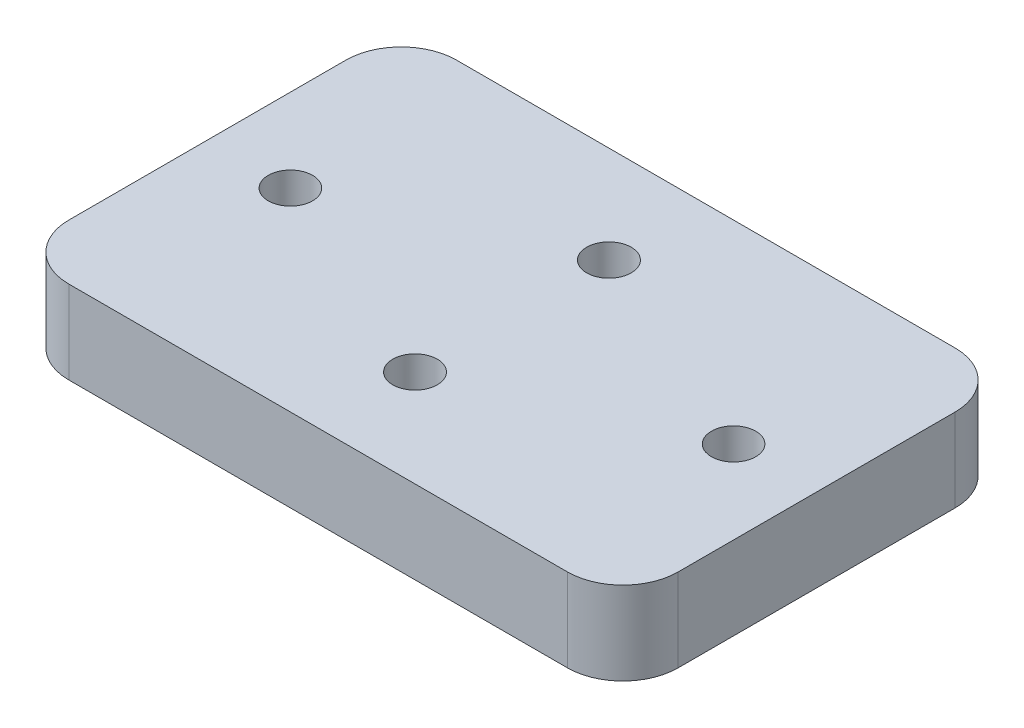
ISO-10303-21;
HEADER;
FILE_DESCRIPTION(('STEP AP214'),'2;1');
FILE_NAME('part.step','',(''),(''),'','','');
FILE_SCHEMA(('AUTOMOTIVE_DESIGN { 1 0 10303 214 1 1 1 1 }'));
ENDSEC;
DATA;
#1=APPLICATION_CONTEXT('core data for automotive mechanical design processes');
#2=APPLICATION_PROTOCOL_DEFINITION('international standard','automotive_design',2000,#1);
#3=PRODUCT_CONTEXT('',#1,'mechanical');
#4=PRODUCT('Part','Part','',(#3));
#5=PRODUCT_RELATED_PRODUCT_CATEGORY('part','',(#4));
#6=PRODUCT_DEFINITION_FORMATION('','',#4);
#7=PRODUCT_DEFINITION_CONTEXT('part definition',#1,'design');
#8=PRODUCT_DEFINITION('design','',#6,#7);
#9=PRODUCT_DEFINITION_SHAPE('','',#8);
#10=(LENGTH_UNIT() NAMED_UNIT(*) SI_UNIT(.MILLI.,.METRE.));
#11=(NAMED_UNIT(*) PLANE_ANGLE_UNIT() SI_UNIT($,.RADIAN.));
#12=(NAMED_UNIT(*) SI_UNIT($,.STERADIAN.) SOLID_ANGLE_UNIT());
#13=UNCERTAINTY_MEASURE_WITH_UNIT(LENGTH_MEASURE(1.E-05),#10,'distance_accuracy_value','');
#14=(GEOMETRIC_REPRESENTATION_CONTEXT(3) GLOBAL_UNCERTAINTY_ASSIGNED_CONTEXT((#13)) GLOBAL_UNIT_ASSIGNED_CONTEXT((#10,
#11,#12)) REPRESENTATION_CONTEXT('',''));
#15=CARTESIAN_POINT('',(0.,0.,0.));
#16=DIRECTION('',(0.,0.,1.));
#17=DIRECTION('',(1.,0.,0.));
#18=AXIS2_PLACEMENT_3D('',#15,#16,#17);
#19=CARTESIAN_POINT('',(34.925,9.525,-22.225));
#20=DIRECTION('',(-1.,0.,0.));
#21=DIRECTION('',(0.,0.,1.));
#22=AXIS2_PLACEMENT_3D('',#19,#20,#21);
#23=PLANE('',#22);
#24=DIRECTION('',(0.,0.,-1.));
#25=VECTOR('',#24,1.);
#26=CARTESIAN_POINT('',(34.925,9.525,-22.225));
#27=LINE('',#26,#25);
#28=CARTESIAN_POINT('',(34.925,9.525,15.875));
#29=VERTEX_POINT('',#28);
#30=CARTESIAN_POINT('',(34.925,9.525,-15.875));
#31=VERTEX_POINT('',#30);
#32=EDGE_CURVE('E135',#29,#31,#27,.T.);
#33=ORIENTED_EDGE('',*,*,#32,.F.);
#34=DIRECTION('',(0.,-1.,0.));
#35=VECTOR('',#34,1.);
#36=CARTESIAN_POINT('',(34.925,9.525,15.875));
#37=LINE('',#36,#35);
#38=CARTESIAN_POINT('',(34.925,0.,15.875));
#39=VERTEX_POINT('',#38);
#40=EDGE_CURVE('E174',#29,#39,#37,.T.);
#41=ORIENTED_EDGE('',*,*,#40,.T.);
#42=DIRECTION('',(0.,0.,-1.));
#43=VECTOR('',#42,1.);
#44=CARTESIAN_POINT('',(34.925,0.,-22.225));
#45=LINE('',#44,#43);
#46=CARTESIAN_POINT('',(34.925,0.,-15.875));
#47=VERTEX_POINT('',#46);
#48=EDGE_CURVE('E189',#39,#47,#45,.T.);
#49=ORIENTED_EDGE('',*,*,#48,.T.);
#50=DIRECTION('',(0.,-1.,0.));
#51=VECTOR('',#50,1.);
#52=CARTESIAN_POINT('',(34.925,9.525,-15.875));
#53=LINE('',#52,#51);
#54=EDGE_CURVE('E171',#47,#31,#53,.F.);
#55=ORIENTED_EDGE('',*,*,#54,.T.);
#56=EDGE_LOOP('',(#33,#41,#49,#55));
#57=FACE_BOUND('',#56,.T.);
#58=ADVANCED_FACE('F39',(#57),#23,.F.);
#59=CARTESIAN_POINT('',(-34.925,9.525,-22.225));
#60=DIRECTION('',(0.,0.,1.));
#61=DIRECTION('',(1.,0.,0.));
#62=AXIS2_PLACEMENT_3D('',#59,#60,#61);
#63=PLANE('',#62);
#64=DIRECTION('',(-1.,0.,0.));
#65=VECTOR('',#64,1.);
#66=CARTESIAN_POINT('',(-34.925,9.525,-22.225));
#67=LINE('',#66,#65);
#68=CARTESIAN_POINT('',(28.575,9.525,-22.225));
#69=VERTEX_POINT('',#68);
#70=CARTESIAN_POINT('',(-28.575,9.525,-22.225));
#71=VERTEX_POINT('',#70);
#72=EDGE_CURVE('E140',#69,#71,#67,.T.);
#73=ORIENTED_EDGE('',*,*,#72,.F.);
#74=DIRECTION('',(0.,-1.,0.));
#75=VECTOR('',#74,1.);
#76=CARTESIAN_POINT('',(28.575,9.525,-22.225));
#77=LINE('',#76,#75);
#78=CARTESIAN_POINT('',(28.575,0.,-22.225));
#79=VERTEX_POINT('',#78);
#80=EDGE_CURVE('E11',#69,#79,#77,.T.);
#81=ORIENTED_EDGE('',*,*,#80,.T.);
#82=DIRECTION('',(-1.,0.,0.));
#83=VECTOR('',#82,1.);
#84=CARTESIAN_POINT('',(-34.925,0.,-22.225));
#85=LINE('',#84,#83);
#86=CARTESIAN_POINT('',(-28.575,0.,-22.225));
#87=VERTEX_POINT('',#86);
#88=EDGE_CURVE('E142',#79,#87,#85,.T.);
#89=ORIENTED_EDGE('',*,*,#88,.T.);
#90=DIRECTION('',(0.,-1.,0.));
#91=VECTOR('',#90,1.);
#92=CARTESIAN_POINT('',(-28.575,9.525,-22.225));
#93=LINE('',#92,#91);
#94=EDGE_CURVE('E48',#87,#71,#93,.F.);
#95=ORIENTED_EDGE('',*,*,#94,.T.);
#96=EDGE_LOOP('',(#73,#81,#89,#95));
#97=FACE_BOUND('',#96,.T.);
#98=ADVANCED_FACE('F195',(#97),#63,.F.);
#99=CARTESIAN_POINT('',(-34.925,9.525,-22.225));
#100=DIRECTION('',(1.,0.,0.));
#101=DIRECTION('',(0.,0.,-1.));
#102=AXIS2_PLACEMENT_3D('',#99,#100,#101);
#103=PLANE('',#102);
#104=DIRECTION('',(0.,0.,1.));
#105=VECTOR('',#104,1.);
#106=CARTESIAN_POINT('',(-34.925,0.,-22.225));
#107=LINE('',#106,#105);
#108=CARTESIAN_POINT('',(-34.925,0.,-15.875));
#109=VERTEX_POINT('',#108);
#110=CARTESIAN_POINT('',(-34.925,0.,15.875));
#111=VERTEX_POINT('',#110);
#112=EDGE_CURVE('E136',#109,#111,#107,.T.);
#113=ORIENTED_EDGE('',*,*,#112,.T.);
#114=DIRECTION('',(0.,-1.,0.));
#115=VECTOR('',#114,1.);
#116=CARTESIAN_POINT('',(-34.925,9.525,15.875));
#117=LINE('',#116,#115);
#118=CARTESIAN_POINT('',(-34.925,9.525,15.875));
#119=VERTEX_POINT('',#118);
#120=EDGE_CURVE('E111',#111,#119,#117,.F.);
#121=ORIENTED_EDGE('',*,*,#120,.T.);
#122=DIRECTION('',(0.,0.,1.));
#123=VECTOR('',#122,1.);
#124=CARTESIAN_POINT('',(-34.925,9.525,-22.225));
#125=LINE('',#124,#123);
#126=CARTESIAN_POINT('',(-34.925,9.525,-15.875));
#127=VERTEX_POINT('',#126);
#128=EDGE_CURVE('E180',#127,#119,#125,.T.);
#129=ORIENTED_EDGE('',*,*,#128,.F.);
#130=DIRECTION('',(0.,-1.,0.));
#131=VECTOR('',#130,1.);
#132=CARTESIAN_POINT('',(-34.925,9.525,-15.875));
#133=LINE('',#132,#131);
#134=EDGE_CURVE('E117',#127,#109,#133,.T.);
#135=ORIENTED_EDGE('',*,*,#134,.T.);
#136=EDGE_LOOP('',(#113,#121,#129,#135));
#137=FACE_BOUND('',#136,.T.);
#138=ADVANCED_FACE('F202',(#137),#103,.F.);
#139=CARTESIAN_POINT('',(-34.925,9.525,22.225));
#140=DIRECTION('',(0.,0.,-1.));
#141=DIRECTION('',(-1.,0.,0.));
#142=AXIS2_PLACEMENT_3D('',#139,#140,#141);
#143=PLANE('',#142);
#144=DIRECTION('',(1.,0.,0.));
#145=VECTOR('',#144,1.);
#146=CARTESIAN_POINT('',(-34.925,9.525,22.225));
#147=LINE('',#146,#145);
#148=CARTESIAN_POINT('',(-28.575,9.525,22.225));
#149=VERTEX_POINT('',#148);
#150=CARTESIAN_POINT('',(28.575,9.525,22.225));
#151=VERTEX_POINT('',#150);
#152=EDGE_CURVE('E127',#149,#151,#147,.T.);
#153=ORIENTED_EDGE('',*,*,#152,.F.);
#154=DIRECTION('',(0.,-1.,0.));
#155=VECTOR('',#154,1.);
#156=CARTESIAN_POINT('',(-28.575,9.525,22.225));
#157=LINE('',#156,#155);
#158=CARTESIAN_POINT('',(-28.575,0.,22.225));
#159=VERTEX_POINT('',#158);
#160=EDGE_CURVE('E110',#149,#159,#157,.T.);
#161=ORIENTED_EDGE('',*,*,#160,.T.);
#162=DIRECTION('',(1.,0.,0.));
#163=VECTOR('',#162,1.);
#164=CARTESIAN_POINT('',(-34.925,0.,22.225));
#165=LINE('',#164,#163);
#166=CARTESIAN_POINT('',(28.575,0.,22.225));
#167=VERTEX_POINT('',#166);
#168=EDGE_CURVE('E124',#159,#167,#165,.T.);
#169=ORIENTED_EDGE('',*,*,#168,.T.);
#170=DIRECTION('',(0.,-1.,0.));
#171=VECTOR('',#170,1.);
#172=CARTESIAN_POINT('',(28.575,9.525,22.225));
#173=LINE('',#172,#171);
#174=EDGE_CURVE('E130',#167,#151,#173,.F.);
#175=ORIENTED_EDGE('',*,*,#174,.T.);
#176=EDGE_LOOP('',(#153,#161,#169,#175));
#177=FACE_BOUND('',#176,.T.);
#178=ADVANCED_FACE('F123',(#177),#143,.F.);
#179=CARTESIAN_POINT('',(0.,9.525,0.));
#180=DIRECTION('',(0.,1.,0.));
#181=DIRECTION('',(0.,0.,1.));
#182=AXIS2_PLACEMENT_3D('',#179,#180,#181);
#183=PLANE('',#182);
#184=CARTESIAN_POINT('',(-25.4,9.525,0.));
#185=DIRECTION('',(0.,-1.,0.));
#186=DIRECTION('',(0.,0.,-1.));
#187=AXIS2_PLACEMENT_3D('',#184,#185,#186);
#188=CIRCLE('',#187,2.54);
#189=CARTESIAN_POINT('',(-25.4,9.525,-2.53999999999999));
#190=VERTEX_POINT('',#189);
#191=EDGE_CURVE('E386',#190,#190,#188,.T.);
#192=ORIENTED_EDGE('',*,*,#191,.T.);
#193=EDGE_LOOP('',(#192));
#194=FACE_BOUND('',#193,.T.);
#195=CARTESIAN_POINT('',(25.4,9.525,0.));
#196=DIRECTION('',(0.,-1.,0.));
#197=DIRECTION('',(0.,0.,-1.));
#198=AXIS2_PLACEMENT_3D('',#195,#196,#197);
#199=CIRCLE('',#198,2.54);
#200=CARTESIAN_POINT('',(25.4,9.525,-2.53999999999999));
#201=VERTEX_POINT('',#200);
#202=EDGE_CURVE('E378',#201,#201,#199,.T.);
#203=ORIENTED_EDGE('',*,*,#202,.T.);
#204=EDGE_LOOP('',(#203));
#205=FACE_BOUND('',#204,.T.);
#206=CARTESIAN_POINT('',(0.,9.525,-11.1125));
#207=DIRECTION('',(0.,-1.,0.));
#208=DIRECTION('',(0.,0.,-1.));
#209=AXIS2_PLACEMENT_3D('',#206,#207,#208);
#210=CIRCLE('',#209,2.5527);
#211=CARTESIAN_POINT('',(0.,9.525,-13.6652));
#212=VERTEX_POINT('',#211);
#213=EDGE_CURVE('E364',#212,#212,#210,.T.);
#214=ORIENTED_EDGE('',*,*,#213,.T.);
#215=EDGE_LOOP('',(#214));
#216=FACE_BOUND('',#215,.T.);
#217=CARTESIAN_POINT('',(0.,9.525,11.1125));
#218=DIRECTION('',(0.,-1.,0.));
#219=DIRECTION('',(0.,0.,-1.));
#220=AXIS2_PLACEMENT_3D('',#217,#218,#219);
#221=CIRCLE('',#220,2.5527);
#222=CARTESIAN_POINT('',(0.,9.525,8.5598));
#223=VERTEX_POINT('',#222);
#224=EDGE_CURVE('E192',#223,#223,#221,.T.);
#225=ORIENTED_EDGE('',*,*,#224,.T.);
#226=EDGE_LOOP('',(#225));
#227=FACE_BOUND('',#226,.T.);
#228=ORIENTED_EDGE('',*,*,#128,.T.);
#229=CARTESIAN_POINT('',(-28.575,9.525,15.875));
#230=DIRECTION('',(0.,1.,0.));
#231=DIRECTION('',(0.,0.,1.));
#232=AXIS2_PLACEMENT_3D('',#229,#230,#231);
#233=CIRCLE('',#232,6.35);
#234=EDGE_CURVE('E168',#119,#149,#233,.T.);
#235=ORIENTED_EDGE('',*,*,#234,.T.);
#236=ORIENTED_EDGE('',*,*,#152,.T.);
#237=CARTESIAN_POINT('',(28.575,9.525,15.875));
#238=DIRECTION('',(0.,1.,0.));
#239=DIRECTION('',(0.,0.,1.));
#240=AXIS2_PLACEMENT_3D('',#237,#238,#239);
#241=CIRCLE('',#240,6.35);
#242=EDGE_CURVE('E165',#151,#29,#241,.T.);
#243=ORIENTED_EDGE('',*,*,#242,.T.);
#244=ORIENTED_EDGE('',*,*,#32,.T.);
#245=CARTESIAN_POINT('',(28.575,9.525,-15.875));
#246=DIRECTION('',(0.,1.,0.));
#247=DIRECTION('',(0.,0.,1.));
#248=AXIS2_PLACEMENT_3D('',#245,#246,#247);
#249=CIRCLE('',#248,6.35);
#250=EDGE_CURVE('E61',#31,#69,#249,.T.);
#251=ORIENTED_EDGE('',*,*,#250,.T.);
#252=ORIENTED_EDGE('',*,*,#72,.T.);
#253=CARTESIAN_POINT('',(-28.575,9.525,-15.875));
#254=DIRECTION('',(0.,1.,0.));
#255=DIRECTION('',(0.,0.,1.));
#256=AXIS2_PLACEMENT_3D('',#253,#254,#255);
#257=CIRCLE('',#256,6.35);
#258=EDGE_CURVE('E160',#71,#127,#257,.T.);
#259=ORIENTED_EDGE('',*,*,#258,.T.);
#260=EDGE_LOOP('',(#228,#235,#236,#243,#244,#251,#252,#259));
#261=FACE_BOUND('',#260,.T.);
#262=ADVANCED_FACE('F200',(#194,#205,#216,#227,#261),#183,.T.);
#263=CARTESIAN_POINT('',(0.,0.,0.));
#264=DIRECTION('',(0.,1.,0.));
#265=DIRECTION('',(0.,0.,1.));
#266=AXIS2_PLACEMENT_3D('',#263,#264,#265);
#267=PLANE('',#266);
#268=CARTESIAN_POINT('',(-25.4,0.,0.));
#269=DIRECTION('',(0.,-1.,0.));
#270=DIRECTION('',(0.,0.,-1.));
#271=AXIS2_PLACEMENT_3D('',#268,#269,#270);
#272=CIRCLE('',#271,2.54);
#273=CARTESIAN_POINT('',(-25.4,0.,-2.54));
#274=VERTEX_POINT('',#273);
#275=EDGE_CURVE('E390',#274,#274,#272,.T.);
#276=ORIENTED_EDGE('',*,*,#275,.F.);
#277=EDGE_LOOP('',(#276));
#278=FACE_BOUND('',#277,.T.);
#279=CARTESIAN_POINT('',(25.4,0.,0.));
#280=DIRECTION('',(0.,-1.,0.));
#281=DIRECTION('',(0.,0.,-1.));
#282=AXIS2_PLACEMENT_3D('',#279,#280,#281);
#283=CIRCLE('',#282,2.54);
#284=CARTESIAN_POINT('',(25.4,0.,-2.54));
#285=VERTEX_POINT('',#284);
#286=EDGE_CURVE('E382',#285,#285,#283,.T.);
#287=ORIENTED_EDGE('',*,*,#286,.F.);
#288=EDGE_LOOP('',(#287));
#289=FACE_BOUND('',#288,.T.);
#290=CARTESIAN_POINT('',(0.,0.,-11.1125));
#291=DIRECTION('',(0.,-1.,0.));
#292=DIRECTION('',(0.,0.,-1.));
#293=AXIS2_PLACEMENT_3D('',#290,#291,#292);
#294=CIRCLE('',#293,4.8895);
#295=CARTESIAN_POINT('',(0.,0.,-16.002));
#296=VERTEX_POINT('',#295);
#297=EDGE_CURVE('E374',#296,#296,#294,.T.);
#298=ORIENTED_EDGE('',*,*,#297,.F.);
#299=EDGE_LOOP('',(#298));
#300=FACE_BOUND('',#299,.T.);
#301=CARTESIAN_POINT('',(0.,0.,11.1125));
#302=DIRECTION('',(0.,-1.,0.));
#303=DIRECTION('',(0.,0.,-1.));
#304=AXIS2_PLACEMENT_3D('',#301,#302,#303);
#305=CIRCLE('',#304,4.8895);
#306=CARTESIAN_POINT('',(0.,0.,6.223));
#307=VERTEX_POINT('',#306);
#308=EDGE_CURVE('E359',#307,#307,#305,.T.);
#309=ORIENTED_EDGE('',*,*,#308,.F.);
#310=EDGE_LOOP('',(#309));
#311=FACE_BOUND('',#310,.T.);
#312=ORIENTED_EDGE('',*,*,#168,.F.);
#313=CARTESIAN_POINT('',(-28.575,0.,15.875));
#314=DIRECTION('',(0.,1.,0.));
#315=DIRECTION('',(0.,0.,1.));
#316=AXIS2_PLACEMENT_3D('',#313,#314,#315);
#317=CIRCLE('',#316,6.35);
#318=EDGE_CURVE('E106',#159,#111,#317,.F.);
#319=ORIENTED_EDGE('',*,*,#318,.T.);
#320=ORIENTED_EDGE('',*,*,#112,.F.);
#321=CARTESIAN_POINT('',(-28.575,0.,-15.875));
#322=DIRECTION('',(0.,1.,0.));
#323=DIRECTION('',(0.,0.,1.));
#324=AXIS2_PLACEMENT_3D('',#321,#322,#323);
#325=CIRCLE('',#324,6.35);
#326=EDGE_CURVE('E129',#109,#87,#325,.F.);
#327=ORIENTED_EDGE('',*,*,#326,.T.);
#328=ORIENTED_EDGE('',*,*,#88,.F.);
#329=CARTESIAN_POINT('',(28.575,0.,-15.875));
#330=DIRECTION('',(0.,1.,0.));
#331=DIRECTION('',(0.,0.,1.));
#332=AXIS2_PLACEMENT_3D('',#329,#330,#331);
#333=CIRCLE('',#332,6.35);
#334=EDGE_CURVE('E150',#79,#47,#333,.F.);
#335=ORIENTED_EDGE('',*,*,#334,.T.);
#336=ORIENTED_EDGE('',*,*,#48,.F.);
#337=CARTESIAN_POINT('',(28.575,0.,15.875));
#338=DIRECTION('',(0.,1.,0.));
#339=DIRECTION('',(0.,0.,1.));
#340=AXIS2_PLACEMENT_3D('',#337,#338,#339);
#341=CIRCLE('',#340,6.35);
#342=EDGE_CURVE('E118',#39,#167,#341,.F.);
#343=ORIENTED_EDGE('',*,*,#342,.T.);
#344=EDGE_LOOP('',(#312,#319,#320,#327,#328,#335,#336,#343));
#345=FACE_BOUND('',#344,.T.);
#346=ADVANCED_FACE('F132',(#278,#289,#300,#311,#345),#267,.F.);
#347=CARTESIAN_POINT('',(0.,0.,11.1125));
#348=DIRECTION('',(0.,-1.,0.));
#349=DIRECTION('',(0.,0.,-1.));
#350=AXIS2_PLACEMENT_3D('',#347,#348,#349);
#351=CYLINDRICAL_SURFACE('',#350,2.5527);
#352=ORIENTED_EDGE('',*,*,#224,.F.);
#353=EDGE_LOOP('',(#352));
#354=FACE_BOUND('',#353,.T.);
#355=CARTESIAN_POINT('',(0.,2.68818089399406,11.1125));
#356=DIRECTION('',(0.,-1.,0.));
#357=DIRECTION('',(0.,0.,-1.));
#358=AXIS2_PLACEMENT_3D('',#355,#356,#357);
#359=CIRCLE('',#358,2.5527);
#360=CARTESIAN_POINT('',(0.,2.68818089399406,8.5598));
#361=VERTEX_POINT('',#360);
#362=EDGE_CURVE('E357',#361,#361,#359,.T.);
#363=ORIENTED_EDGE('',*,*,#362,.T.);
#364=EDGE_LOOP('',(#363));
#365=FACE_BOUND('',#364,.T.);
#366=ADVANCED_FACE('F262',(#354,#365),#351,.F.);
#367=CARTESIAN_POINT('',(0.,0.,11.1125));
#368=DIRECTION('',(0.,-1.,0.));
#369=DIRECTION('',(0.,0.,-1.));
#370=AXIS2_PLACEMENT_3D('',#367,#368,#369);
#371=CONICAL_SURFACE('',#370,4.8895,0.715584993317675);
#372=ORIENTED_EDGE('',*,*,#362,.F.);
#373=EDGE_LOOP('',(#372));
#374=FACE_BOUND('',#373,.T.);
#375=ORIENTED_EDGE('',*,*,#308,.T.);
#376=EDGE_LOOP('',(#375));
#377=FACE_BOUND('',#376,.T.);
#378=ADVANCED_FACE('F331',(#374,#377),#371,.F.);
#379=CARTESIAN_POINT('',(0.,0.,-11.1125));
#380=DIRECTION('',(0.,-1.,0.));
#381=DIRECTION('',(0.,0.,-1.));
#382=AXIS2_PLACEMENT_3D('',#379,#380,#381);
#383=CYLINDRICAL_SURFACE('',#382,2.5527);
#384=ORIENTED_EDGE('',*,*,#213,.F.);
#385=EDGE_LOOP('',(#384));
#386=FACE_BOUND('',#385,.T.);
#387=CARTESIAN_POINT('',(0.,2.68818089399406,-11.1125));
#388=DIRECTION('',(0.,-1.,0.));
#389=DIRECTION('',(0.,0.,-1.));
#390=AXIS2_PLACEMENT_3D('',#387,#388,#389);
#391=CIRCLE('',#390,2.5527);
#392=CARTESIAN_POINT('',(0.,2.68818089399406,-13.6652));
#393=VERTEX_POINT('',#392);
#394=EDGE_CURVE('E370',#393,#393,#391,.T.);
#395=ORIENTED_EDGE('',*,*,#394,.T.);
#396=EDGE_LOOP('',(#395));
#397=FACE_BOUND('',#396,.T.);
#398=ADVANCED_FACE('F321',(#386,#397),#383,.F.);
#399=CARTESIAN_POINT('',(0.,0.,-11.1125));
#400=DIRECTION('',(0.,-1.,0.));
#401=DIRECTION('',(0.,0.,-1.));
#402=AXIS2_PLACEMENT_3D('',#399,#400,#401);
#403=CONICAL_SURFACE('',#402,4.8895,0.715584993317675);
#404=ORIENTED_EDGE('',*,*,#394,.F.);
#405=EDGE_LOOP('',(#404));
#406=FACE_BOUND('',#405,.T.);
#407=ORIENTED_EDGE('',*,*,#297,.T.);
#408=EDGE_LOOP('',(#407));
#409=FACE_BOUND('',#408,.T.);
#410=ADVANCED_FACE('F311',(#406,#409),#403,.F.);
#411=CARTESIAN_POINT('',(25.4,0.,0.));
#412=DIRECTION('',(0.,-1.,0.));
#413=DIRECTION('',(0.,0.,-1.));
#414=AXIS2_PLACEMENT_3D('',#411,#412,#413);
#415=CYLINDRICAL_SURFACE('',#414,2.54);
#416=ORIENTED_EDGE('',*,*,#202,.F.);
#417=EDGE_LOOP('',(#416));
#418=FACE_BOUND('',#417,.T.);
#419=ORIENTED_EDGE('',*,*,#286,.T.);
#420=EDGE_LOOP('',(#419));
#421=FACE_BOUND('',#420,.T.);
#422=ADVANCED_FACE('F301',(#418,#421),#415,.F.);
#423=CARTESIAN_POINT('',(-25.4,0.,0.));
#424=DIRECTION('',(0.,-1.,0.));
#425=DIRECTION('',(0.,0.,-1.));
#426=AXIS2_PLACEMENT_3D('',#423,#424,#425);
#427=CYLINDRICAL_SURFACE('',#426,2.54);
#428=ORIENTED_EDGE('',*,*,#191,.F.);
#429=EDGE_LOOP('',(#428));
#430=FACE_BOUND('',#429,.T.);
#431=ORIENTED_EDGE('',*,*,#275,.T.);
#432=EDGE_LOOP('',(#431));
#433=FACE_BOUND('',#432,.T.);
#434=ADVANCED_FACE('F221',(#430,#433),#427,.F.);
#435=CARTESIAN_POINT('',(-28.575,9.525,15.875));
#436=DIRECTION('',(0.,-1.,0.));
#437=DIRECTION('',(0.,0.,-1.));
#438=AXIS2_PLACEMENT_3D('',#435,#436,#437);
#439=CYLINDRICAL_SURFACE('',#438,6.35);
#440=ORIENTED_EDGE('',*,*,#234,.F.);
#441=ORIENTED_EDGE('',*,*,#120,.F.);
#442=ORIENTED_EDGE('',*,*,#318,.F.);
#443=ORIENTED_EDGE('',*,*,#160,.F.);
#444=EDGE_LOOP('',(#440,#441,#442,#443));
#445=FACE_BOUND('',#444,.T.);
#446=ADVANCED_FACE('F109',(#445),#439,.T.);
#447=CARTESIAN_POINT('',(28.575,9.525,15.875));
#448=DIRECTION('',(0.,-1.,0.));
#449=DIRECTION('',(0.,0.,-1.));
#450=AXIS2_PLACEMENT_3D('',#447,#448,#449);
#451=CYLINDRICAL_SURFACE('',#450,6.35);
#452=ORIENTED_EDGE('',*,*,#242,.F.);
#453=ORIENTED_EDGE('',*,*,#174,.F.);
#454=ORIENTED_EDGE('',*,*,#342,.F.);
#455=ORIENTED_EDGE('',*,*,#40,.F.);
#456=EDGE_LOOP('',(#452,#453,#454,#455));
#457=FACE_BOUND('',#456,.T.);
#458=ADVANCED_FACE('F220',(#457),#451,.T.);
#459=CARTESIAN_POINT('',(28.575,9.525,-15.875));
#460=DIRECTION('',(0.,-1.,0.));
#461=DIRECTION('',(0.,0.,-1.));
#462=AXIS2_PLACEMENT_3D('',#459,#460,#461);
#463=CYLINDRICAL_SURFACE('',#462,6.35);
#464=ORIENTED_EDGE('',*,*,#250,.F.);
#465=ORIENTED_EDGE('',*,*,#54,.F.);
#466=ORIENTED_EDGE('',*,*,#334,.F.);
#467=ORIENTED_EDGE('',*,*,#80,.F.);
#468=EDGE_LOOP('',(#464,#465,#466,#467));
#469=FACE_BOUND('',#468,.T.);
#470=ADVANCED_FACE('F223',(#469),#463,.T.);
#471=CARTESIAN_POINT('',(-28.575,9.525,-15.875));
#472=DIRECTION('',(0.,-1.,0.));
#473=DIRECTION('',(0.,0.,-1.));
#474=AXIS2_PLACEMENT_3D('',#471,#472,#473);
#475=CYLINDRICAL_SURFACE('',#474,6.35);
#476=ORIENTED_EDGE('',*,*,#258,.F.);
#477=ORIENTED_EDGE('',*,*,#94,.F.);
#478=ORIENTED_EDGE('',*,*,#326,.F.);
#479=ORIENTED_EDGE('',*,*,#134,.F.);
#480=EDGE_LOOP('',(#476,#477,#478,#479));
#481=FACE_BOUND('',#480,.T.);
#482=ADVANCED_FACE('F41',(#481),#475,.T.);
#483=CLOSED_SHELL('',(#58,#98,#138,#178,#262,#346,#366,#378,#398,#410,#422,#434,#446,#458,#470,#482));
#484=MANIFOLD_SOLID_BREP('B2',#483);
#485=ADVANCED_BREP_SHAPE_REPRESENTATION('',(#18,#484),#14);
#486=SHAPE_DEFINITION_REPRESENTATION(#9,#485);
ENDSEC;
END-ISO-10303-21;
